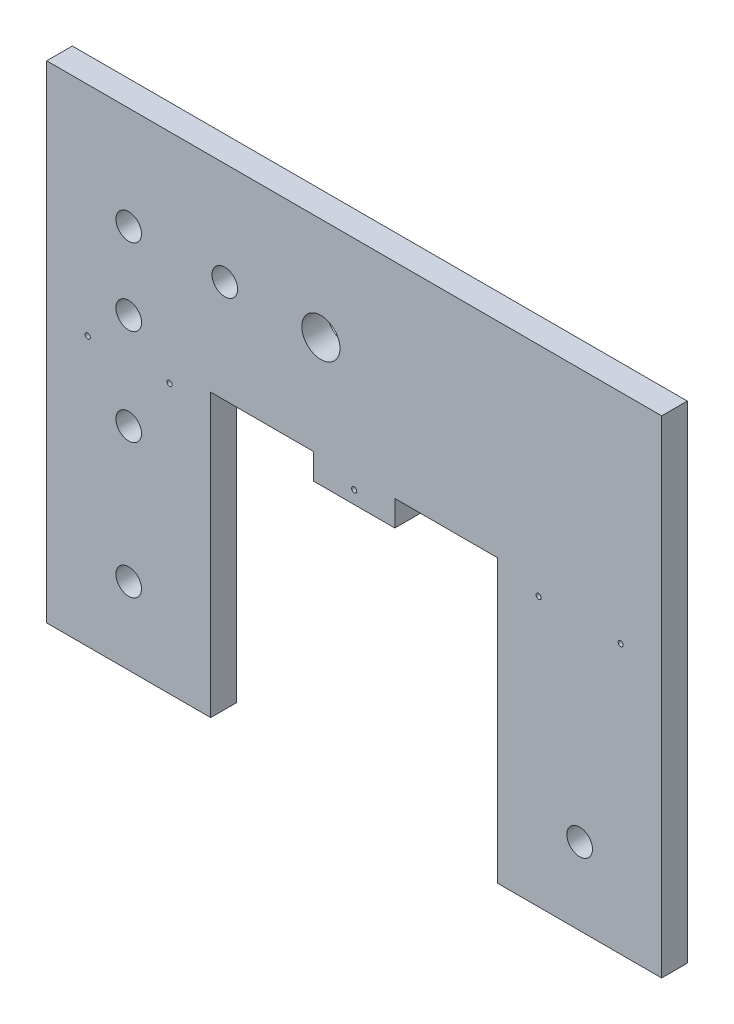
ISO-10303-21;
HEADER;
FILE_DESCRIPTION(('STEP AP214'),'2;1');
FILE_NAME('part.step','',(''),(''),'','','');
FILE_SCHEMA(('AUTOMOTIVE_DESIGN { 1 0 10303 214 1 1 1 1 }'));
ENDSEC;
DATA;
#1=APPLICATION_CONTEXT('core data for automotive mechanical design processes');
#2=APPLICATION_PROTOCOL_DEFINITION('international standard','automotive_design',2000,#1);
#3=PRODUCT_CONTEXT('',#1,'mechanical');
#4=PRODUCT('Part','Part','',(#3));
#5=PRODUCT_RELATED_PRODUCT_CATEGORY('part','',(#4));
#6=PRODUCT_DEFINITION_FORMATION('','',#4);
#7=PRODUCT_DEFINITION_CONTEXT('part definition',#1,'design');
#8=PRODUCT_DEFINITION('design','',#6,#7);
#9=PRODUCT_DEFINITION_SHAPE('','',#8);
#10=(LENGTH_UNIT() NAMED_UNIT(*) SI_UNIT(.MILLI.,.METRE.));
#11=(NAMED_UNIT(*) PLANE_ANGLE_UNIT() SI_UNIT($,.RADIAN.));
#12=(NAMED_UNIT(*) SI_UNIT($,.STERADIAN.) SOLID_ANGLE_UNIT());
#13=UNCERTAINTY_MEASURE_WITH_UNIT(LENGTH_MEASURE(1.E-05),#10,'distance_accuracy_value','');
#14=(GEOMETRIC_REPRESENTATION_CONTEXT(3) GLOBAL_UNCERTAINTY_ASSIGNED_CONTEXT((#13)) GLOBAL_UNIT_ASSIGNED_CONTEXT((#10,
#11,#12)) REPRESENTATION_CONTEXT('',''));
#15=CARTESIAN_POINT('',(0.,0.,0.));
#16=DIRECTION('',(0.,0.,1.));
#17=DIRECTION('',(1.,0.,0.));
#18=AXIS2_PLACEMENT_3D('',#15,#16,#17);
#19=CARTESIAN_POINT('',(0.,0.,6.35));
#20=DIRECTION('',(0.,0.,1.));
#21=DIRECTION('',(1.,0.,0.));
#22=AXIS2_PLACEMENT_3D('',#19,#20,#21);
#23=PLANE('',#22);
#24=CARTESIAN_POINT('',(142.239999999999,66.675,6.35));
#25=DIRECTION('',(0.,0.,1.));
#26=DIRECTION('',(1.,0.,0.));
#27=AXIS2_PLACEMENT_3D('',#24,#25,#26);
#28=CIRCLE('',#27,0.63499999999999);
#29=CARTESIAN_POINT('',(142.874999999999,66.675,6.35));
#30=VERTEX_POINT('',#29);
#31=EDGE_CURVE('E513',#30,#30,#28,.T.);
#32=ORIENTED_EDGE('',*,*,#31,.F.);
#33=EDGE_LOOP('',(#32));
#34=FACE_BOUND('',#33,.T.);
#35=CARTESIAN_POINT('',(121.919999999999,66.675,6.35));
#36=DIRECTION('',(0.,0.,1.));
#37=DIRECTION('',(1.,0.,0.));
#38=AXIS2_PLACEMENT_3D('',#35,#36,#37);
#39=CIRCLE('',#38,0.634999999999985);
#40=CARTESIAN_POINT('',(122.554999999999,66.675,6.35));
#41=VERTEX_POINT('',#40);
#42=EDGE_CURVE('E515',#41,#41,#39,.T.);
#43=ORIENTED_EDGE('',*,*,#42,.F.);
#44=EDGE_LOOP('',(#43));
#45=FACE_BOUND('',#44,.T.);
#46=CARTESIAN_POINT('',(30.4358060540484,66.675,6.35));
#47=DIRECTION('',(0.,0.,1.));
#48=DIRECTION('',(1.,0.,0.));
#49=AXIS2_PLACEMENT_3D('',#46,#47,#48);
#50=CIRCLE('',#49,0.635000000003909);
#51=CARTESIAN_POINT('',(31.0708060540524,66.675,6.35));
#52=VERTEX_POINT('',#51);
#53=EDGE_CURVE('E521',#52,#52,#50,.T.);
#54=ORIENTED_EDGE('',*,*,#53,.F.);
#55=EDGE_LOOP('',(#54));
#56=FACE_BOUND('',#55,.T.);
#57=CARTESIAN_POINT('',(10.1599999999993,66.675,6.35));
#58=DIRECTION('',(0.,0.,1.));
#59=DIRECTION('',(1.,0.,0.));
#60=AXIS2_PLACEMENT_3D('',#57,#58,#59);
#61=CIRCLE('',#60,0.635000000000001);
#62=CARTESIAN_POINT('',(10.7949999999993,66.675,6.35));
#63=VERTEX_POINT('',#62);
#64=EDGE_CURVE('E527',#63,#63,#61,.T.);
#65=ORIENTED_EDGE('',*,*,#64,.F.);
#66=EDGE_LOOP('',(#65));
#67=FACE_BOUND('',#66,.T.);
#68=CARTESIAN_POINT('',(76.1999999999997,66.675,6.35));
#69=DIRECTION('',(0.,0.,1.));
#70=DIRECTION('',(1.,0.,0.));
#71=AXIS2_PLACEMENT_3D('',#68,#69,#70);
#72=CIRCLE('',#71,0.635000000000003);
#73=CARTESIAN_POINT('',(76.8349999999997,66.675,6.35));
#74=VERTEX_POINT('',#73);
#75=EDGE_CURVE('E286',#74,#74,#72,.T.);
#76=ORIENTED_EDGE('',*,*,#75,.F.);
#77=EDGE_LOOP('',(#76));
#78=FACE_BOUND('',#77,.T.);
#79=DIRECTION('',(-1.,0.,0.));
#80=VECTOR('',#79,1.);
#81=CARTESIAN_POINT('',(111.76,69.85,6.35));
#82=LINE('',#81,#80);
#83=CARTESIAN_POINT('',(111.76,69.85,6.35));
#84=VERTEX_POINT('',#83);
#85=CARTESIAN_POINT('',(86.2617104137634,69.85,6.35));
#86=VERTEX_POINT('',#85);
#87=EDGE_CURVE('E283',#84,#86,#82,.T.);
#88=ORIENTED_EDGE('',*,*,#87,.F.);
#89=DIRECTION('',(0.,-1.,0.));
#90=VECTOR('',#89,1.);
#91=CARTESIAN_POINT('',(111.76,63.5,6.35));
#92=LINE('',#91,#90);
#93=CARTESIAN_POINT('',(111.76,0.,6.35));
#94=VERTEX_POINT('',#93);
#95=EDGE_CURVE('E110',#84,#94,#92,.T.);
#96=ORIENTED_EDGE('',*,*,#95,.T.);
#97=DIRECTION('',(1.,0.,0.));
#98=VECTOR('',#97,1.);
#99=CARTESIAN_POINT('',(111.76,0.,6.35));
#100=LINE('',#99,#98);
#101=CARTESIAN_POINT('',(152.4,0.,6.35));
#102=VERTEX_POINT('',#101);
#103=EDGE_CURVE('E102',#94,#102,#100,.T.);
#104=ORIENTED_EDGE('',*,*,#103,.T.);
#105=DIRECTION('',(0.,1.,0.));
#106=VECTOR('',#105,1.);
#107=CARTESIAN_POINT('',(152.4,69.85,6.35));
#108=LINE('',#107,#106);
#109=CARTESIAN_POINT('',(152.4,120.65,6.35));
#110=VERTEX_POINT('',#109);
#111=EDGE_CURVE('E107',#102,#110,#108,.T.);
#112=ORIENTED_EDGE('',*,*,#111,.T.);
#113=DIRECTION('',(-1.,0.,0.));
#114=VECTOR('',#113,1.);
#115=CARTESIAN_POINT('',(111.76,120.65,6.35));
#116=LINE('',#115,#114);
#117=CARTESIAN_POINT('',(0.,120.65,6.35));
#118=VERTEX_POINT('',#117);
#119=EDGE_CURVE('E57',#110,#118,#116,.T.);
#120=ORIENTED_EDGE('',*,*,#119,.T.);
#121=DIRECTION('',(0.,-1.,0.));
#122=VECTOR('',#121,1.);
#123=CARTESIAN_POINT('',(0.,69.85,6.35));
#124=LINE('',#123,#122);
#125=CARTESIAN_POINT('',(0.,0.,6.35));
#126=VERTEX_POINT('',#125);
#127=EDGE_CURVE('E149',#118,#126,#124,.T.);
#128=ORIENTED_EDGE('',*,*,#127,.T.);
#129=DIRECTION('',(1.,0.,0.));
#130=VECTOR('',#129,1.);
#131=CARTESIAN_POINT('',(0.,0.,6.35));
#132=LINE('',#131,#130);
#133=CARTESIAN_POINT('',(40.64,0.,6.35));
#134=VERTEX_POINT('',#133);
#135=EDGE_CURVE('E92',#126,#134,#132,.T.);
#136=ORIENTED_EDGE('',*,*,#135,.T.);
#137=DIRECTION('',(0.,1.,0.));
#138=VECTOR('',#137,1.);
#139=CARTESIAN_POINT('',(40.64,0.,6.35));
#140=LINE('',#139,#138);
#141=CARTESIAN_POINT('',(40.64,69.85,6.35));
#142=VERTEX_POINT('',#141);
#143=EDGE_CURVE('E160',#134,#142,#140,.T.);
#144=ORIENTED_EDGE('',*,*,#143,.T.);
#145=DIRECTION('',(-1.,0.,0.));
#146=VECTOR('',#145,1.);
#147=CARTESIAN_POINT('',(40.64,69.85,6.35));
#148=LINE('',#147,#146);
#149=CARTESIAN_POINT('',(66.1382895862361,69.85,6.35));
#150=VERTEX_POINT('',#149);
#151=EDGE_CURVE('E179',#150,#142,#148,.T.);
#152=ORIENTED_EDGE('',*,*,#151,.F.);
#153=DIRECTION('',(0.,1.,0.));
#154=VECTOR('',#153,1.);
#155=CARTESIAN_POINT('',(66.1382895862361,63.5,6.35));
#156=LINE('',#155,#154);
#157=CARTESIAN_POINT('',(66.1382895862361,63.5,6.35));
#158=VERTEX_POINT('',#157);
#159=EDGE_CURVE('E183',#158,#150,#156,.T.);
#160=ORIENTED_EDGE('',*,*,#159,.F.);
#161=DIRECTION('',(1.,0.,0.));
#162=VECTOR('',#161,1.);
#163=CARTESIAN_POINT('',(40.64,63.5,6.35));
#164=LINE('',#163,#162);
#165=CARTESIAN_POINT('',(86.2617104137634,63.5,6.35));
#166=VERTEX_POINT('',#165);
#167=EDGE_CURVE('E236',#158,#166,#164,.T.);
#168=ORIENTED_EDGE('',*,*,#167,.T.);
#169=DIRECTION('',(0.,-1.,0.));
#170=VECTOR('',#169,1.);
#171=CARTESIAN_POINT('',(86.2617104137634,63.5,6.35));
#172=LINE('',#171,#170);
#173=EDGE_CURVE('E244',#86,#166,#172,.T.);
#174=ORIENTED_EDGE('',*,*,#173,.F.);
#175=EDGE_LOOP('',(#88,#96,#104,#112,#120,#128,#136,#144,#152,#160,#168,#174));
#176=FACE_BOUND('',#175,.T.);
#177=CARTESIAN_POINT('',(20.32,19.05,6.35));
#178=DIRECTION('',(0.,0.,1.));
#179=DIRECTION('',(1.,0.,0.));
#180=AXIS2_PLACEMENT_3D('',#177,#178,#179);
#181=CIRCLE('',#180,3.175);
#182=CARTESIAN_POINT('',(23.495,19.05,6.35));
#183=VERTEX_POINT('',#182);
#184=EDGE_CURVE('E199',#183,#183,#181,.T.);
#185=ORIENTED_EDGE('',*,*,#184,.F.);
#186=EDGE_LOOP('',(#185));
#187=FACE_BOUND('',#186,.T.);
#188=CARTESIAN_POINT('',(20.32,52.3875,6.35));
#189=DIRECTION('',(0.,0.,1.));
#190=DIRECTION('',(1.,0.,0.));
#191=AXIS2_PLACEMENT_3D('',#188,#189,#190);
#192=CIRCLE('',#191,3.175);
#193=CARTESIAN_POINT('',(23.495,52.3875,6.35));
#194=VERTEX_POINT('',#193);
#195=EDGE_CURVE('E211',#194,#194,#192,.T.);
#196=ORIENTED_EDGE('',*,*,#195,.F.);
#197=EDGE_LOOP('',(#196));
#198=FACE_BOUND('',#197,.T.);
#199=CARTESIAN_POINT('',(67.945,95.25,6.35));
#200=DIRECTION('',(0.,0.,1.));
#201=DIRECTION('',(1.,0.,0.));
#202=AXIS2_PLACEMENT_3D('',#199,#200,#201);
#203=CIRCLE('',#202,4.73710000000001);
#204=CARTESIAN_POINT('',(72.6821,95.25,6.35));
#205=VERTEX_POINT('',#204);
#206=EDGE_CURVE('E223',#205,#205,#203,.T.);
#207=ORIENTED_EDGE('',*,*,#206,.F.);
#208=EDGE_LOOP('',(#207));
#209=FACE_BOUND('',#208,.T.);
#210=CARTESIAN_POINT('',(20.32,95.25,6.35));
#211=DIRECTION('',(0.,0.,1.));
#212=DIRECTION('',(1.,0.,0.));
#213=AXIS2_PLACEMENT_3D('',#210,#211,#212);
#214=CIRCLE('',#213,3.175);
#215=CARTESIAN_POINT('',(23.495,95.25,6.35));
#216=VERTEX_POINT('',#215);
#217=EDGE_CURVE('E135',#216,#216,#214,.T.);
#218=ORIENTED_EDGE('',*,*,#217,.F.);
#219=EDGE_LOOP('',(#218));
#220=FACE_BOUND('',#219,.T.);
#221=CARTESIAN_POINT('',(20.32,76.2,6.35));
#222=DIRECTION('',(0.,0.,1.));
#223=DIRECTION('',(1.,0.,0.));
#224=AXIS2_PLACEMENT_3D('',#221,#222,#223);
#225=CIRCLE('',#224,3.175);
#226=CARTESIAN_POINT('',(23.495,76.2,6.35));
#227=VERTEX_POINT('',#226);
#228=EDGE_CURVE('E217',#227,#227,#225,.T.);
#229=ORIENTED_EDGE('',*,*,#228,.F.);
#230=EDGE_LOOP('',(#229));
#231=FACE_BOUND('',#230,.T.);
#232=CARTESIAN_POINT('',(132.08,19.05,6.35));
#233=DIRECTION('',(0.,0.,1.));
#234=DIRECTION('',(1.,0.,0.));
#235=AXIS2_PLACEMENT_3D('',#232,#233,#234);
#236=CIRCLE('',#235,3.175);
#237=CARTESIAN_POINT('',(135.255,19.05,6.35));
#238=VERTEX_POINT('',#237);
#239=EDGE_CURVE('E205',#238,#238,#236,.T.);
#240=ORIENTED_EDGE('',*,*,#239,.F.);
#241=EDGE_LOOP('',(#240));
#242=FACE_BOUND('',#241,.T.);
#243=CARTESIAN_POINT('',(44.1325,95.25,6.35));
#244=DIRECTION('',(0.,0.,1.));
#245=DIRECTION('',(1.,0.,0.));
#246=AXIS2_PLACEMENT_3D('',#243,#244,#245);
#247=CIRCLE('',#246,3.175);
#248=CARTESIAN_POINT('',(47.3075,95.25,6.35));
#249=VERTEX_POINT('',#248);
#250=EDGE_CURVE('E193',#249,#249,#247,.T.);
#251=ORIENTED_EDGE('',*,*,#250,.F.);
#252=EDGE_LOOP('',(#251));
#253=FACE_BOUND('',#252,.T.);
#254=ADVANCED_FACE('F33',(#34,#45,#56,#67,#78,#176,#187,#198,#209,#220,#231,#242,#253),#23,.T.);
#255=CARTESIAN_POINT('',(0.,0.,0.));
#256=DIRECTION('',(0.,0.,1.));
#257=DIRECTION('',(1.,0.,0.));
#258=AXIS2_PLACEMENT_3D('',#255,#256,#257);
#259=PLANE('',#258);
#260=CARTESIAN_POINT('',(142.239999999999,66.675,0.));
#261=DIRECTION('',(0.,0.,1.));
#262=DIRECTION('',(1.,0.,0.));
#263=AXIS2_PLACEMENT_3D('',#260,#261,#262);
#264=CIRCLE('',#263,0.63499999999999);
#265=CARTESIAN_POINT('',(142.874999999999,66.675,0.));
#266=VERTEX_POINT('',#265);
#267=EDGE_CURVE('E511',#266,#266,#264,.T.);
#268=ORIENTED_EDGE('',*,*,#267,.T.);
#269=EDGE_LOOP('',(#268));
#270=FACE_BOUND('',#269,.T.);
#271=CARTESIAN_POINT('',(121.919999999999,66.675,0.));
#272=DIRECTION('',(0.,0.,1.));
#273=DIRECTION('',(1.,0.,0.));
#274=AXIS2_PLACEMENT_3D('',#271,#272,#273);
#275=CIRCLE('',#274,0.634999999999985);
#276=CARTESIAN_POINT('',(122.554999999999,66.675,0.));
#277=VERTEX_POINT('',#276);
#278=EDGE_CURVE('E518',#277,#277,#275,.T.);
#279=ORIENTED_EDGE('',*,*,#278,.T.);
#280=EDGE_LOOP('',(#279));
#281=FACE_BOUND('',#280,.T.);
#282=CARTESIAN_POINT('',(30.4358060540484,66.675,0.));
#283=DIRECTION('',(0.,0.,1.));
#284=DIRECTION('',(1.,0.,0.));
#285=AXIS2_PLACEMENT_3D('',#282,#283,#284);
#286=CIRCLE('',#285,0.635000000003909);
#287=CARTESIAN_POINT('',(31.0708060540524,66.675,0.));
#288=VERTEX_POINT('',#287);
#289=EDGE_CURVE('E524',#288,#288,#286,.T.);
#290=ORIENTED_EDGE('',*,*,#289,.T.);
#291=EDGE_LOOP('',(#290));
#292=FACE_BOUND('',#291,.T.);
#293=CARTESIAN_POINT('',(10.1599999999993,66.675,0.));
#294=DIRECTION('',(0.,0.,1.));
#295=DIRECTION('',(1.,0.,0.));
#296=AXIS2_PLACEMENT_3D('',#293,#294,#295);
#297=CIRCLE('',#296,0.635000000000001);
#298=CARTESIAN_POINT('',(10.7949999999993,66.675,0.));
#299=VERTEX_POINT('',#298);
#300=EDGE_CURVE('E530',#299,#299,#297,.T.);
#301=ORIENTED_EDGE('',*,*,#300,.T.);
#302=EDGE_LOOP('',(#301));
#303=FACE_BOUND('',#302,.T.);
#304=CARTESIAN_POINT('',(76.1999999999997,66.675,0.));
#305=DIRECTION('',(0.,0.,1.));
#306=DIRECTION('',(1.,0.,0.));
#307=AXIS2_PLACEMENT_3D('',#304,#305,#306);
#308=CIRCLE('',#307,0.635000000000003);
#309=CARTESIAN_POINT('',(76.8349999999997,66.675,0.));
#310=VERTEX_POINT('',#309);
#311=EDGE_CURVE('E289',#310,#310,#308,.T.);
#312=ORIENTED_EDGE('',*,*,#311,.T.);
#313=EDGE_LOOP('',(#312));
#314=FACE_BOUND('',#313,.T.);
#315=DIRECTION('',(0.,-1.,0.));
#316=VECTOR('',#315,1.);
#317=CARTESIAN_POINT('',(111.76,63.5,0.));
#318=LINE('',#317,#316);
#319=CARTESIAN_POINT('',(111.76,69.85,0.));
#320=VERTEX_POINT('',#319);
#321=CARTESIAN_POINT('',(111.76,0.,0.));
#322=VERTEX_POINT('',#321);
#323=EDGE_CURVE('E141',#320,#322,#318,.T.);
#324=ORIENTED_EDGE('',*,*,#323,.F.);
#325=DIRECTION('',(-1.,0.,0.));
#326=VECTOR('',#325,1.);
#327=CARTESIAN_POINT('',(111.76,69.85,0.));
#328=LINE('',#327,#326);
#329=CARTESIAN_POINT('',(86.2617104137634,69.85,0.));
#330=VERTEX_POINT('',#329);
#331=EDGE_CURVE('E270',#320,#330,#328,.T.);
#332=ORIENTED_EDGE('',*,*,#331,.T.);
#333=DIRECTION('',(0.,-1.,0.));
#334=VECTOR('',#333,1.);
#335=CARTESIAN_POINT('',(86.2617104137634,63.5,0.));
#336=LINE('',#335,#334);
#337=CARTESIAN_POINT('',(86.2617104137634,63.5,0.));
#338=VERTEX_POINT('',#337);
#339=EDGE_CURVE('E278',#330,#338,#336,.T.);
#340=ORIENTED_EDGE('',*,*,#339,.T.);
#341=DIRECTION('',(1.,0.,0.));
#342=VECTOR('',#341,1.);
#343=CARTESIAN_POINT('',(40.64,63.5,0.));
#344=LINE('',#343,#342);
#345=CARTESIAN_POINT('',(66.1382895862361,63.5,0.));
#346=VERTEX_POINT('',#345);
#347=EDGE_CURVE('E138',#346,#338,#344,.T.);
#348=ORIENTED_EDGE('',*,*,#347,.F.);
#349=DIRECTION('',(0.,1.,0.));
#350=VECTOR('',#349,1.);
#351=CARTESIAN_POINT('',(66.1382895862361,63.5,0.));
#352=LINE('',#351,#350);
#353=CARTESIAN_POINT('',(66.1382895862361,69.85,0.));
#354=VERTEX_POINT('',#353);
#355=EDGE_CURVE('E48',#346,#354,#352,.T.);
#356=ORIENTED_EDGE('',*,*,#355,.T.);
#357=DIRECTION('',(-1.,0.,0.));
#358=VECTOR('',#357,1.);
#359=CARTESIAN_POINT('',(40.64,69.85,0.));
#360=LINE('',#359,#358);
#361=CARTESIAN_POINT('',(40.64,69.85,0.));
#362=VERTEX_POINT('',#361);
#363=EDGE_CURVE('E169',#354,#362,#360,.T.);
#364=ORIENTED_EDGE('',*,*,#363,.T.);
#365=DIRECTION('',(0.,1.,0.));
#366=VECTOR('',#365,1.);
#367=CARTESIAN_POINT('',(40.64,0.,0.));
#368=LINE('',#367,#366);
#369=CARTESIAN_POINT('',(40.64,0.,0.));
#370=VERTEX_POINT('',#369);
#371=EDGE_CURVE('E134',#370,#362,#368,.T.);
#372=ORIENTED_EDGE('',*,*,#371,.F.);
#373=DIRECTION('',(1.,0.,0.));
#374=VECTOR('',#373,1.);
#375=CARTESIAN_POINT('',(0.,0.,0.));
#376=LINE('',#375,#374);
#377=CARTESIAN_POINT('',(0.,0.,0.));
#378=VERTEX_POINT('',#377);
#379=EDGE_CURVE('E132',#378,#370,#376,.T.);
#380=ORIENTED_EDGE('',*,*,#379,.F.);
#381=DIRECTION('',(0.,-1.,0.));
#382=VECTOR('',#381,1.);
#383=CARTESIAN_POINT('',(0.,69.85,0.));
#384=LINE('',#383,#382);
#385=CARTESIAN_POINT('',(0.,120.65,0.));
#386=VERTEX_POINT('',#385);
#387=EDGE_CURVE('E147',#386,#378,#384,.T.);
#388=ORIENTED_EDGE('',*,*,#387,.F.);
#389=DIRECTION('',(-1.,0.,0.));
#390=VECTOR('',#389,1.);
#391=CARTESIAN_POINT('',(0.,120.65,0.));
#392=LINE('',#391,#390);
#393=CARTESIAN_POINT('',(152.4,120.65,0.));
#394=VERTEX_POINT('',#393);
#395=EDGE_CURVE('E84',#394,#386,#392,.T.);
#396=ORIENTED_EDGE('',*,*,#395,.F.);
#397=DIRECTION('',(0.,1.,0.));
#398=VECTOR('',#397,1.);
#399=CARTESIAN_POINT('',(152.4,69.85,0.));
#400=LINE('',#399,#398);
#401=CARTESIAN_POINT('',(152.4,0.,0.));
#402=VERTEX_POINT('',#401);
#403=EDGE_CURVE('E144',#402,#394,#400,.T.);
#404=ORIENTED_EDGE('',*,*,#403,.F.);
#405=DIRECTION('',(1.,0.,0.));
#406=VECTOR('',#405,1.);
#407=CARTESIAN_POINT('',(111.76,0.,0.));
#408=LINE('',#407,#406);
#409=EDGE_CURVE('E120',#322,#402,#408,.T.);
#410=ORIENTED_EDGE('',*,*,#409,.F.);
#411=EDGE_LOOP('',(#324,#332,#340,#348,#356,#364,#372,#380,#388,#396,#404,#410));
#412=FACE_BOUND('',#411,.T.);
#413=CARTESIAN_POINT('',(20.32,95.25,0.));
#414=DIRECTION('',(0.,0.,1.));
#415=DIRECTION('',(1.,0.,0.));
#416=AXIS2_PLACEMENT_3D('',#413,#414,#415);
#417=CIRCLE('',#416,3.175);
#418=CARTESIAN_POINT('',(23.495,95.25,0.));
#419=VERTEX_POINT('',#418);
#420=EDGE_CURVE('E226',#419,#419,#417,.T.);
#421=ORIENTED_EDGE('',*,*,#420,.T.);
#422=EDGE_LOOP('',(#421));
#423=FACE_BOUND('',#422,.T.);
#424=CARTESIAN_POINT('',(67.945,95.25,0.));
#425=DIRECTION('',(0.,0.,1.));
#426=DIRECTION('',(1.,0.,0.));
#427=AXIS2_PLACEMENT_3D('',#424,#425,#426);
#428=CIRCLE('',#427,4.73710000000001);
#429=CARTESIAN_POINT('',(72.6821,95.25,0.));
#430=VERTEX_POINT('',#429);
#431=EDGE_CURVE('E220',#430,#430,#428,.T.);
#432=ORIENTED_EDGE('',*,*,#431,.T.);
#433=EDGE_LOOP('',(#432));
#434=FACE_BOUND('',#433,.T.);
#435=CARTESIAN_POINT('',(20.32,76.2,0.));
#436=DIRECTION('',(0.,0.,1.));
#437=DIRECTION('',(1.,0.,0.));
#438=AXIS2_PLACEMENT_3D('',#435,#436,#437);
#439=CIRCLE('',#438,3.175);
#440=CARTESIAN_POINT('',(23.495,76.2,0.));
#441=VERTEX_POINT('',#440);
#442=EDGE_CURVE('E214',#441,#441,#439,.T.);
#443=ORIENTED_EDGE('',*,*,#442,.T.);
#444=EDGE_LOOP('',(#443));
#445=FACE_BOUND('',#444,.T.);
#446=CARTESIAN_POINT('',(20.32,52.3875,0.));
#447=DIRECTION('',(0.,0.,1.));
#448=DIRECTION('',(1.,0.,0.));
#449=AXIS2_PLACEMENT_3D('',#446,#447,#448);
#450=CIRCLE('',#449,3.175);
#451=CARTESIAN_POINT('',(23.495,52.3875,0.));
#452=VERTEX_POINT('',#451);
#453=EDGE_CURVE('E208',#452,#452,#450,.T.);
#454=ORIENTED_EDGE('',*,*,#453,.T.);
#455=EDGE_LOOP('',(#454));
#456=FACE_BOUND('',#455,.T.);
#457=CARTESIAN_POINT('',(132.08,19.05,0.));
#458=DIRECTION('',(0.,0.,1.));
#459=DIRECTION('',(1.,0.,0.));
#460=AXIS2_PLACEMENT_3D('',#457,#458,#459);
#461=CIRCLE('',#460,3.175);
#462=CARTESIAN_POINT('',(135.255,19.05,0.));
#463=VERTEX_POINT('',#462);
#464=EDGE_CURVE('E202',#463,#463,#461,.T.);
#465=ORIENTED_EDGE('',*,*,#464,.T.);
#466=EDGE_LOOP('',(#465));
#467=FACE_BOUND('',#466,.T.);
#468=CARTESIAN_POINT('',(20.32,19.05,0.));
#469=DIRECTION('',(0.,0.,1.));
#470=DIRECTION('',(1.,0.,0.));
#471=AXIS2_PLACEMENT_3D('',#468,#469,#470);
#472=CIRCLE('',#471,3.175);
#473=CARTESIAN_POINT('',(23.495,19.05,0.));
#474=VERTEX_POINT('',#473);
#475=EDGE_CURVE('E196',#474,#474,#472,.T.);
#476=ORIENTED_EDGE('',*,*,#475,.T.);
#477=EDGE_LOOP('',(#476));
#478=FACE_BOUND('',#477,.T.);
#479=CARTESIAN_POINT('',(44.1325,95.25,0.));
#480=DIRECTION('',(0.,0.,1.));
#481=DIRECTION('',(1.,0.,0.));
#482=AXIS2_PLACEMENT_3D('',#479,#480,#481);
#483=CIRCLE('',#482,3.175);
#484=CARTESIAN_POINT('',(47.3075,95.25,0.));
#485=VERTEX_POINT('',#484);
#486=EDGE_CURVE('E191',#485,#485,#483,.T.);
#487=ORIENTED_EDGE('',*,*,#486,.T.);
#488=EDGE_LOOP('',(#487));
#489=FACE_BOUND('',#488,.T.);
#490=ADVANCED_FACE('F165',(#270,#281,#292,#303,#314,#412,#423,#434,#445,#456,#467,#478,#489),
#259,.F.);
#491=CARTESIAN_POINT('',(0.,0.,6.35));
#492=DIRECTION('',(0.,1.,0.));
#493=DIRECTION('',(0.,0.,1.));
#494=AXIS2_PLACEMENT_3D('',#491,#492,#493);
#495=PLANE('',#494);
#496=ORIENTED_EDGE('',*,*,#379,.T.);
#497=DIRECTION('',(0.,0.,-1.));
#498=VECTOR('',#497,1.);
#499=CARTESIAN_POINT('',(40.64,0.,6.35));
#500=LINE('',#499,#498);
#501=EDGE_CURVE('E41',#134,#370,#500,.T.);
#502=ORIENTED_EDGE('',*,*,#501,.F.);
#503=ORIENTED_EDGE('',*,*,#135,.F.);
#504=DIRECTION('',(0.,0.,-1.));
#505=VECTOR('',#504,1.);
#506=CARTESIAN_POINT('',(0.,0.,6.35));
#507=LINE('',#506,#505);
#508=EDGE_CURVE('E11',#126,#378,#507,.T.);
#509=ORIENTED_EDGE('',*,*,#508,.T.);
#510=EDGE_LOOP('',(#496,#502,#503,#509));
#511=FACE_BOUND('',#510,.T.);
#512=ADVANCED_FACE('F35',(#511),#495,.F.);
#513=CARTESIAN_POINT('',(40.64,0.,6.35));
#514=DIRECTION('',(-1.,0.,0.));
#515=DIRECTION('',(0.,-1.,0.));
#516=AXIS2_PLACEMENT_3D('',#513,#514,#515);
#517=PLANE('',#516);
#518=ORIENTED_EDGE('',*,*,#371,.T.);
#519=DIRECTION('',(0.,0.,1.));
#520=VECTOR('',#519,1.);
#521=CARTESIAN_POINT('',(40.64,69.85,0.));
#522=LINE('',#521,#520);
#523=EDGE_CURVE('E189',#362,#142,#522,.T.);
#524=ORIENTED_EDGE('',*,*,#523,.T.);
#525=ORIENTED_EDGE('',*,*,#143,.F.);
#526=ORIENTED_EDGE('',*,*,#501,.T.);
#527=EDGE_LOOP('',(#518,#524,#525,#526));
#528=FACE_BOUND('',#527,.T.);
#529=ADVANCED_FACE('F156',(#528),#517,.F.);
#530=CARTESIAN_POINT('',(40.64,63.5,6.35));
#531=DIRECTION('',(0.,1.,0.));
#532=DIRECTION('',(0.,0.,1.));
#533=AXIS2_PLACEMENT_3D('',#530,#531,#532);
#534=PLANE('',#533);
#535=ORIENTED_EDGE('',*,*,#347,.T.);
#536=DIRECTION('',(0.,0.,1.));
#537=VECTOR('',#536,1.);
#538=CARTESIAN_POINT('',(86.2617104137634,63.5,0.));
#539=LINE('',#538,#537);
#540=EDGE_CURVE('E186',#338,#166,#539,.T.);
#541=ORIENTED_EDGE('',*,*,#540,.T.);
#542=ORIENTED_EDGE('',*,*,#167,.F.);
#543=DIRECTION('',(0.,0.,1.));
#544=VECTOR('',#543,1.);
#545=CARTESIAN_POINT('',(66.1382895862361,63.5,0.));
#546=LINE('',#545,#544);
#547=EDGE_CURVE('E175',#346,#158,#546,.T.);
#548=ORIENTED_EDGE('',*,*,#547,.F.);
#549=EDGE_LOOP('',(#535,#541,#542,#548));
#550=FACE_BOUND('',#549,.T.);
#551=ADVANCED_FACE('F251',(#550),#534,.F.);
#552=CARTESIAN_POINT('',(111.76,63.5,6.35));
#553=DIRECTION('',(1.,0.,0.));
#554=DIRECTION('',(0.,1.,0.));
#555=AXIS2_PLACEMENT_3D('',#552,#553,#554);
#556=PLANE('',#555);
#557=ORIENTED_EDGE('',*,*,#323,.T.);
#558=DIRECTION('',(0.,0.,-1.));
#559=VECTOR('',#558,1.);
#560=CARTESIAN_POINT('',(111.76,0.,6.35));
#561=LINE('',#560,#559);
#562=EDGE_CURVE('E123',#94,#322,#561,.T.);
#563=ORIENTED_EDGE('',*,*,#562,.F.);
#564=ORIENTED_EDGE('',*,*,#95,.F.);
#565=DIRECTION('',(0.,0.,1.));
#566=VECTOR('',#565,1.);
#567=CARTESIAN_POINT('',(111.76,69.85,0.));
#568=LINE('',#567,#566);
#569=EDGE_CURVE('E273',#320,#84,#568,.T.);
#570=ORIENTED_EDGE('',*,*,#569,.F.);
#571=EDGE_LOOP('',(#557,#563,#564,#570));
#572=FACE_BOUND('',#571,.T.);
#573=ADVANCED_FACE('F274',(#572),#556,.F.);
#574=CARTESIAN_POINT('',(111.76,0.,6.35));
#575=DIRECTION('',(0.,1.,0.));
#576=DIRECTION('',(-1.,0.,0.));
#577=AXIS2_PLACEMENT_3D('',#574,#575,#576);
#578=PLANE('',#577);
#579=ORIENTED_EDGE('',*,*,#409,.T.);
#580=DIRECTION('',(0.,0.,-1.));
#581=VECTOR('',#580,1.);
#582=CARTESIAN_POINT('',(152.4,0.,6.35));
#583=LINE('',#582,#581);
#584=EDGE_CURVE('E117',#102,#402,#583,.T.);
#585=ORIENTED_EDGE('',*,*,#584,.F.);
#586=ORIENTED_EDGE('',*,*,#103,.F.);
#587=ORIENTED_EDGE('',*,*,#562,.T.);
#588=EDGE_LOOP('',(#579,#585,#586,#587));
#589=FACE_BOUND('',#588,.T.);
#590=ADVANCED_FACE('F118',(#589),#578,.F.);
#591=CARTESIAN_POINT('',(152.4,69.85,6.35));
#592=DIRECTION('',(-1.,0.,0.));
#593=DIRECTION('',(0.,-1.,0.));
#594=AXIS2_PLACEMENT_3D('',#591,#592,#593);
#595=PLANE('',#594);
#596=ORIENTED_EDGE('',*,*,#403,.T.);
#597=DIRECTION('',(0.,0.,-1.));
#598=VECTOR('',#597,1.);
#599=CARTESIAN_POINT('',(152.4,120.65,6.35));
#600=LINE('',#599,#598);
#601=EDGE_CURVE('E124',#110,#394,#600,.T.);
#602=ORIENTED_EDGE('',*,*,#601,.F.);
#603=ORIENTED_EDGE('',*,*,#111,.F.);
#604=ORIENTED_EDGE('',*,*,#584,.T.);
#605=EDGE_LOOP('',(#596,#602,#603,#604));
#606=FACE_BOUND('',#605,.T.);
#607=ADVANCED_FACE('F126',(#606),#595,.F.);
#608=CARTESIAN_POINT('',(0.,120.65,6.35));
#609=DIRECTION('',(0.,-1.,0.));
#610=DIRECTION('',(1.,0.,0.));
#611=AXIS2_PLACEMENT_3D('',#608,#609,#610);
#612=PLANE('',#611);
#613=ORIENTED_EDGE('',*,*,#395,.T.);
#614=DIRECTION('',(0.,0.,-1.));
#615=VECTOR('',#614,1.);
#616=CARTESIAN_POINT('',(0.,120.65,6.35));
#617=LINE('',#616,#615);
#618=EDGE_CURVE('E128',#118,#386,#617,.T.);
#619=ORIENTED_EDGE('',*,*,#618,.F.);
#620=ORIENTED_EDGE('',*,*,#119,.F.);
#621=ORIENTED_EDGE('',*,*,#601,.T.);
#622=EDGE_LOOP('',(#613,#619,#620,#621));
#623=FACE_BOUND('',#622,.T.);
#624=ADVANCED_FACE('F324',(#623),#612,.F.);
#625=CARTESIAN_POINT('',(0.,69.85,6.35));
#626=DIRECTION('',(1.,0.,0.));
#627=DIRECTION('',(0.,0.,-1.));
#628=AXIS2_PLACEMENT_3D('',#625,#626,#627);
#629=PLANE('',#628);
#630=ORIENTED_EDGE('',*,*,#387,.T.);
#631=ORIENTED_EDGE('',*,*,#508,.F.);
#632=ORIENTED_EDGE('',*,*,#127,.F.);
#633=ORIENTED_EDGE('',*,*,#618,.T.);
#634=EDGE_LOOP('',(#630,#631,#632,#633));
#635=FACE_BOUND('',#634,.T.);
#636=ADVANCED_FACE('F321',(#635),#629,.F.);
#637=CARTESIAN_POINT('',(20.32,95.25,6.35));
#638=DIRECTION('',(0.,0.,-1.));
#639=DIRECTION('',(-1.,0.,0.));
#640=AXIS2_PLACEMENT_3D('',#637,#638,#639);
#641=CYLINDRICAL_SURFACE('',#640,3.175);
#642=ORIENTED_EDGE('',*,*,#217,.T.);
#643=EDGE_LOOP('',(#642));
#644=FACE_BOUND('',#643,.T.);
#645=ORIENTED_EDGE('',*,*,#420,.F.);
#646=EDGE_LOOP('',(#645));
#647=FACE_BOUND('',#646,.T.);
#648=ADVANCED_FACE('F318',(#644,#647),#641,.F.);
#649=CARTESIAN_POINT('',(67.945,95.25,6.35));
#650=DIRECTION('',(0.,0.,-1.));
#651=DIRECTION('',(-1.,0.,0.));
#652=AXIS2_PLACEMENT_3D('',#649,#650,#651);
#653=CYLINDRICAL_SURFACE('',#652,4.73710000000001);
#654=ORIENTED_EDGE('',*,*,#206,.T.);
#655=EDGE_LOOP('',(#654));
#656=FACE_BOUND('',#655,.T.);
#657=ORIENTED_EDGE('',*,*,#431,.F.);
#658=EDGE_LOOP('',(#657));
#659=FACE_BOUND('',#658,.T.);
#660=ADVANCED_FACE('F367',(#656,#659),#653,.F.);
#661=CARTESIAN_POINT('',(20.32,76.2,6.35));
#662=DIRECTION('',(0.,0.,-1.));
#663=DIRECTION('',(-1.,0.,0.));
#664=AXIS2_PLACEMENT_3D('',#661,#662,#663);
#665=CYLINDRICAL_SURFACE('',#664,3.175);
#666=ORIENTED_EDGE('',*,*,#228,.T.);
#667=EDGE_LOOP('',(#666));
#668=FACE_BOUND('',#667,.T.);
#669=ORIENTED_EDGE('',*,*,#442,.F.);
#670=EDGE_LOOP('',(#669));
#671=FACE_BOUND('',#670,.T.);
#672=ADVANCED_FACE('F364',(#668,#671),#665,.F.);
#673=CARTESIAN_POINT('',(20.32,52.3875,6.35));
#674=DIRECTION('',(0.,0.,-1.));
#675=DIRECTION('',(-1.,0.,0.));
#676=AXIS2_PLACEMENT_3D('',#673,#674,#675);
#677=CYLINDRICAL_SURFACE('',#676,3.175);
#678=ORIENTED_EDGE('',*,*,#195,.T.);
#679=EDGE_LOOP('',(#678));
#680=FACE_BOUND('',#679,.T.);
#681=ORIENTED_EDGE('',*,*,#453,.F.);
#682=EDGE_LOOP('',(#681));
#683=FACE_BOUND('',#682,.T.);
#684=ADVANCED_FACE('F360',(#680,#683),#677,.F.);
#685=CARTESIAN_POINT('',(132.08,19.05,6.35));
#686=DIRECTION('',(0.,0.,-1.));
#687=DIRECTION('',(-1.,0.,0.));
#688=AXIS2_PLACEMENT_3D('',#685,#686,#687);
#689=CYLINDRICAL_SURFACE('',#688,3.175);
#690=ORIENTED_EDGE('',*,*,#239,.T.);
#691=EDGE_LOOP('',(#690));
#692=FACE_BOUND('',#691,.T.);
#693=ORIENTED_EDGE('',*,*,#464,.F.);
#694=EDGE_LOOP('',(#693));
#695=FACE_BOUND('',#694,.T.);
#696=ADVANCED_FACE('F356',(#692,#695),#689,.F.);
#697=CARTESIAN_POINT('',(20.32,19.05,6.35));
#698=DIRECTION('',(0.,0.,-1.));
#699=DIRECTION('',(-1.,0.,0.));
#700=AXIS2_PLACEMENT_3D('',#697,#698,#699);
#701=CYLINDRICAL_SURFACE('',#700,3.175);
#702=ORIENTED_EDGE('',*,*,#184,.T.);
#703=EDGE_LOOP('',(#702));
#704=FACE_BOUND('',#703,.T.);
#705=ORIENTED_EDGE('',*,*,#475,.F.);
#706=EDGE_LOOP('',(#705));
#707=FACE_BOUND('',#706,.T.);
#708=ADVANCED_FACE('F350',(#704,#707),#701,.F.);
#709=CARTESIAN_POINT('',(44.1325,95.25,6.35));
#710=DIRECTION('',(0.,0.,-1.));
#711=DIRECTION('',(-1.,0.,0.));
#712=AXIS2_PLACEMENT_3D('',#709,#710,#711);
#713=CYLINDRICAL_SURFACE('',#712,3.175);
#714=ORIENTED_EDGE('',*,*,#250,.T.);
#715=EDGE_LOOP('',(#714));
#716=FACE_BOUND('',#715,.T.);
#717=ORIENTED_EDGE('',*,*,#486,.F.);
#718=EDGE_LOOP('',(#717));
#719=FACE_BOUND('',#718,.T.);
#720=ADVANCED_FACE('F346',(#716,#719),#713,.F.);
#721=CARTESIAN_POINT('',(40.64,69.85,0.));
#722=DIRECTION('',(0.,1.,0.));
#723=DIRECTION('',(0.,0.,1.));
#724=AXIS2_PLACEMENT_3D('',#721,#722,#723);
#725=PLANE('',#724);
#726=ORIENTED_EDGE('',*,*,#151,.T.);
#727=ORIENTED_EDGE('',*,*,#523,.F.);
#728=ORIENTED_EDGE('',*,*,#363,.F.);
#729=DIRECTION('',(0.,0.,1.));
#730=VECTOR('',#729,1.);
#731=CARTESIAN_POINT('',(66.1382895862361,69.85,0.));
#732=LINE('',#731,#730);
#733=EDGE_CURVE('E177',#354,#150,#732,.T.);
#734=ORIENTED_EDGE('',*,*,#733,.T.);
#735=EDGE_LOOP('',(#726,#727,#728,#734));
#736=FACE_BOUND('',#735,.T.);
#737=ADVANCED_FACE('F303',(#736),#725,.F.);
#738=CARTESIAN_POINT('',(66.1382895862361,63.5,0.));
#739=DIRECTION('',(1.,0.,0.));
#740=DIRECTION('',(0.,0.,-1.));
#741=AXIS2_PLACEMENT_3D('',#738,#739,#740);
#742=PLANE('',#741);
#743=ORIENTED_EDGE('',*,*,#159,.T.);
#744=ORIENTED_EDGE('',*,*,#733,.F.);
#745=ORIENTED_EDGE('',*,*,#355,.F.);
#746=ORIENTED_EDGE('',*,*,#547,.T.);
#747=EDGE_LOOP('',(#743,#744,#745,#746));
#748=FACE_BOUND('',#747,.T.);
#749=ADVANCED_FACE('F295',(#748),#742,.F.);
#750=CARTESIAN_POINT('',(86.2617104137634,63.5,0.));
#751=DIRECTION('',(-1.,0.,0.));
#752=DIRECTION('',(0.,0.,1.));
#753=AXIS2_PLACEMENT_3D('',#750,#751,#752);
#754=PLANE('',#753);
#755=ORIENTED_EDGE('',*,*,#173,.T.);
#756=ORIENTED_EDGE('',*,*,#540,.F.);
#757=ORIENTED_EDGE('',*,*,#339,.F.);
#758=DIRECTION('',(0.,0.,1.));
#759=VECTOR('',#758,1.);
#760=CARTESIAN_POINT('',(86.2617104137634,69.85,0.));
#761=LINE('',#760,#759);
#762=EDGE_CURVE('E277',#330,#86,#761,.T.);
#763=ORIENTED_EDGE('',*,*,#762,.T.);
#764=EDGE_LOOP('',(#755,#756,#757,#763));
#765=FACE_BOUND('',#764,.T.);
#766=ADVANCED_FACE('F293',(#765),#754,.F.);
#767=CARTESIAN_POINT('',(111.76,69.85,0.));
#768=DIRECTION('',(0.,1.,0.));
#769=DIRECTION('',(0.,0.,1.));
#770=AXIS2_PLACEMENT_3D('',#767,#768,#769);
#771=PLANE('',#770);
#772=ORIENTED_EDGE('',*,*,#87,.T.);
#773=ORIENTED_EDGE('',*,*,#762,.F.);
#774=ORIENTED_EDGE('',*,*,#331,.F.);
#775=ORIENTED_EDGE('',*,*,#569,.T.);
#776=EDGE_LOOP('',(#772,#773,#774,#775));
#777=FACE_BOUND('',#776,.T.);
#778=ADVANCED_FACE('F279',(#777),#771,.F.);
#779=CARTESIAN_POINT('',(76.1999999999997,66.675,0.));
#780=DIRECTION('',(0.,0.,1.));
#781=DIRECTION('',(1.,0.,0.));
#782=AXIS2_PLACEMENT_3D('',#779,#780,#781);
#783=CYLINDRICAL_SURFACE('',#782,0.635000000000003);
#784=ORIENTED_EDGE('',*,*,#311,.F.);
#785=EDGE_LOOP('',(#784));
#786=FACE_BOUND('',#785,.T.);
#787=ORIENTED_EDGE('',*,*,#75,.T.);
#788=EDGE_LOOP('',(#787));
#789=FACE_BOUND('',#788,.T.);
#790=ADVANCED_FACE('F301',(#786,#789),#783,.F.);
#791=CARTESIAN_POINT('',(10.1599999999993,66.675,0.));
#792=DIRECTION('',(0.,0.,1.));
#793=DIRECTION('',(1.,0.,0.));
#794=AXIS2_PLACEMENT_3D('',#791,#792,#793);
#795=CYLINDRICAL_SURFACE('',#794,0.635000000000001);
#796=ORIENTED_EDGE('',*,*,#300,.F.);
#797=EDGE_LOOP('',(#796));
#798=FACE_BOUND('',#797,.T.);
#799=ORIENTED_EDGE('',*,*,#64,.T.);
#800=EDGE_LOOP('',(#799));
#801=FACE_BOUND('',#800,.T.);
#802=ADVANCED_FACE('F464',(#798,#801),#795,.F.);
#803=CARTESIAN_POINT('',(30.4358060540484,66.675,0.));
#804=DIRECTION('',(0.,0.,1.));
#805=DIRECTION('',(1.,0.,0.));
#806=AXIS2_PLACEMENT_3D('',#803,#804,#805);
#807=CYLINDRICAL_SURFACE('',#806,0.635000000003909);
#808=ORIENTED_EDGE('',*,*,#289,.F.);
#809=EDGE_LOOP('',(#808));
#810=FACE_BOUND('',#809,.T.);
#811=ORIENTED_EDGE('',*,*,#53,.T.);
#812=EDGE_LOOP('',(#811));
#813=FACE_BOUND('',#812,.T.);
#814=ADVANCED_FACE('F474',(#810,#813),#807,.F.);
#815=CARTESIAN_POINT('',(121.919999999999,66.675,0.));
#816=DIRECTION('',(0.,0.,1.));
#817=DIRECTION('',(1.,0.,0.));
#818=AXIS2_PLACEMENT_3D('',#815,#816,#817);
#819=CYLINDRICAL_SURFACE('',#818,0.634999999999985);
#820=ORIENTED_EDGE('',*,*,#278,.F.);
#821=EDGE_LOOP('',(#820));
#822=FACE_BOUND('',#821,.T.);
#823=ORIENTED_EDGE('',*,*,#42,.T.);
#824=EDGE_LOOP('',(#823));
#825=FACE_BOUND('',#824,.T.);
#826=ADVANCED_FACE('F481',(#822,#825),#819,.F.);
#827=CARTESIAN_POINT('',(142.239999999999,66.675,0.));
#828=DIRECTION('',(0.,0.,1.));
#829=DIRECTION('',(1.,0.,0.));
#830=AXIS2_PLACEMENT_3D('',#827,#828,#829);
#831=CYLINDRICAL_SURFACE('',#830,0.63499999999999);
#832=ORIENTED_EDGE('',*,*,#267,.F.);
#833=EDGE_LOOP('',(#832));
#834=FACE_BOUND('',#833,.T.);
#835=ORIENTED_EDGE('',*,*,#31,.T.);
#836=EDGE_LOOP('',(#835));
#837=FACE_BOUND('',#836,.T.);
#838=ADVANCED_FACE('F489',(#834,#837),#831,.F.);
#839=CLOSED_SHELL('',(#254,#490,#512,#529,#551,#573,#590,#607,#624,#636,#648,#660,#672,#684,
#696,#708,#720,#737,#749,#766,#778,#790,#802,#814,#826,#838));
#840=MANIFOLD_SOLID_BREP('B2',#839);
#841=ADVANCED_BREP_SHAPE_REPRESENTATION('',(#18,#840),#14);
#842=SHAPE_DEFINITION_REPRESENTATION(#9,#841);
ENDSEC;
END-ISO-10303-21;
